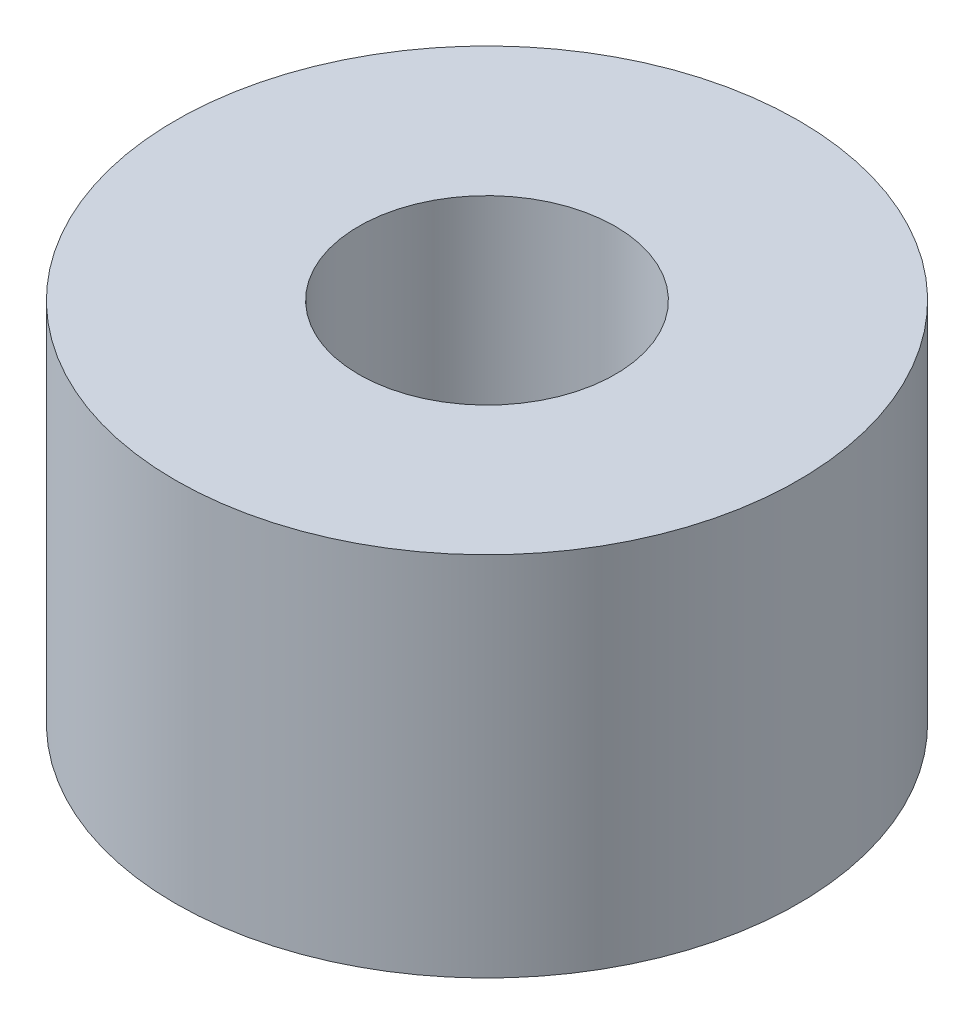
ISO-10303-21;
HEADER;
FILE_DESCRIPTION(('STEP AP214'),'2;1');
FILE_NAME('part.step','',(''),(''),'','','');
FILE_SCHEMA(('AUTOMOTIVE_DESIGN { 1 0 10303 214 1 1 1 1 }'));
ENDSEC;
DATA;
#1=APPLICATION_CONTEXT('core data for automotive mechanical design processes');
#2=APPLICATION_PROTOCOL_DEFINITION('international standard','automotive_design',2000,#1);
#3=PRODUCT_CONTEXT('',#1,'mechanical');
#4=PRODUCT('Part','Part','',(#3));
#5=PRODUCT_RELATED_PRODUCT_CATEGORY('part','',(#4));
#6=PRODUCT_DEFINITION_FORMATION('','',#4);
#7=PRODUCT_DEFINITION_CONTEXT('part definition',#1,'design');
#8=PRODUCT_DEFINITION('design','',#6,#7);
#9=PRODUCT_DEFINITION_SHAPE('','',#8);
#10=(LENGTH_UNIT() NAMED_UNIT(*) SI_UNIT(.MILLI.,.METRE.));
#11=(NAMED_UNIT(*) PLANE_ANGLE_UNIT() SI_UNIT($,.RADIAN.));
#12=(NAMED_UNIT(*) SI_UNIT($,.STERADIAN.) SOLID_ANGLE_UNIT());
#13=UNCERTAINTY_MEASURE_WITH_UNIT(LENGTH_MEASURE(1.E-05),#10,'distance_accuracy_value','');
#14=(GEOMETRIC_REPRESENTATION_CONTEXT(3) GLOBAL_UNCERTAINTY_ASSIGNED_CONTEXT((#13)) GLOBAL_UNIT_ASSIGNED_CONTEXT((#10,
#11,#12)) REPRESENTATION_CONTEXT('',''));
#15=CARTESIAN_POINT('',(0.,0.,0.));
#16=DIRECTION('',(0.,0.,1.));
#17=DIRECTION('',(1.,0.,0.));
#18=AXIS2_PLACEMENT_3D('',#15,#16,#17);
#19=CARTESIAN_POINT('',(0.,3.,0.));
#20=DIRECTION('',(0.,1.,0.));
#21=DIRECTION('',(0.,0.,1.));
#22=AXIS2_PLACEMENT_3D('',#19,#20,#21);
#23=PLANE('',#22);
#24=CARTESIAN_POINT('',(0.,3.,0.));
#25=DIRECTION('',(0.,1.,0.));
#26=DIRECTION('',(0.,0.,1.));
#27=AXIS2_PLACEMENT_3D('',#24,#25,#26);
#28=CIRCLE('',#27,2.55);
#29=CARTESIAN_POINT('',(0.,3.,2.55));
#30=VERTEX_POINT('',#29);
#31=EDGE_CURVE('E10',#30,#30,#28,.T.);
#32=ORIENTED_EDGE('',*,*,#31,.T.);
#33=EDGE_LOOP('',(#32));
#34=FACE_BOUND('',#33,.T.);
#35=CARTESIAN_POINT('',(0.,3.,0.));
#36=DIRECTION('',(0.,1.,0.));
#37=DIRECTION('',(0.,0.,1.));
#38=AXIS2_PLACEMENT_3D('',#35,#36,#37);
#39=CIRCLE('',#38,1.05);
#40=CARTESIAN_POINT('',(0.,3.,1.05));
#41=VERTEX_POINT('',#40);
#42=EDGE_CURVE('E42',#41,#41,#39,.T.);
#43=ORIENTED_EDGE('',*,*,#42,.F.);
#44=EDGE_LOOP('',(#43));
#45=FACE_BOUND('',#44,.T.);
#46=ADVANCED_FACE('F31',(#34,#45),#23,.T.);
#47=CARTESIAN_POINT('',(0.,0.,0.));
#48=DIRECTION('',(0.,1.,0.));
#49=DIRECTION('',(0.,0.,1.));
#50=AXIS2_PLACEMENT_3D('',#47,#48,#49);
#51=PLANE('',#50);
#52=CARTESIAN_POINT('',(0.,0.,0.));
#53=DIRECTION('',(0.,1.,0.));
#54=DIRECTION('',(0.,0.,1.));
#55=AXIS2_PLACEMENT_3D('',#52,#53,#54);
#56=CIRCLE('',#55,2.55);
#57=CARTESIAN_POINT('',(0.,0.,2.55));
#58=VERTEX_POINT('',#57);
#59=EDGE_CURVE('E35',#58,#58,#56,.T.);
#60=ORIENTED_EDGE('',*,*,#59,.F.);
#61=EDGE_LOOP('',(#60));
#62=FACE_BOUND('',#61,.T.);
#63=CARTESIAN_POINT('',(0.,0.,0.));
#64=DIRECTION('',(0.,1.,0.));
#65=DIRECTION('',(0.,0.,1.));
#66=AXIS2_PLACEMENT_3D('',#63,#64,#65);
#67=CIRCLE('',#66,1.05);
#68=CARTESIAN_POINT('',(0.,0.,1.05));
#69=VERTEX_POINT('',#68);
#70=EDGE_CURVE('E44',#69,#69,#67,.T.);
#71=ORIENTED_EDGE('',*,*,#70,.T.);
#72=EDGE_LOOP('',(#71));
#73=FACE_BOUND('',#72,.T.);
#74=ADVANCED_FACE('F54',(#62,#73),#51,.F.);
#75=CARTESIAN_POINT('',(0.,3.,0.));
#76=DIRECTION('',(0.,-1.,0.));
#77=DIRECTION('',(0.,0.,-1.));
#78=AXIS2_PLACEMENT_3D('',#75,#76,#77);
#79=CYLINDRICAL_SURFACE('',#78,2.55);
#80=ORIENTED_EDGE('',*,*,#31,.F.);
#81=EDGE_LOOP('',(#80));
#82=FACE_BOUND('',#81,.T.);
#83=ORIENTED_EDGE('',*,*,#59,.T.);
#84=EDGE_LOOP('',(#83));
#85=FACE_BOUND('',#84,.T.);
#86=ADVANCED_FACE('F33',(#82,#85),#79,.T.);
#87=CARTESIAN_POINT('',(0.,3.,0.));
#88=DIRECTION('',(0.,-1.,0.));
#89=DIRECTION('',(0.,0.,-1.));
#90=AXIS2_PLACEMENT_3D('',#87,#88,#89);
#91=CYLINDRICAL_SURFACE('',#90,1.05);
#92=ORIENTED_EDGE('',*,*,#42,.T.);
#93=EDGE_LOOP('',(#92));
#94=FACE_BOUND('',#93,.T.);
#95=ORIENTED_EDGE('',*,*,#70,.F.);
#96=EDGE_LOOP('',(#95));
#97=FACE_BOUND('',#96,.T.);
#98=ADVANCED_FACE('F50',(#94,#97),#91,.F.);
#99=CLOSED_SHELL('',(#46,#74,#86,#98));
#100=MANIFOLD_SOLID_BREP('B2',#99);
#101=ADVANCED_BREP_SHAPE_REPRESENTATION('',(#18,#100),#14);
#102=SHAPE_DEFINITION_REPRESENTATION(#9,#101);
ENDSEC;
END-ISO-10303-21;
